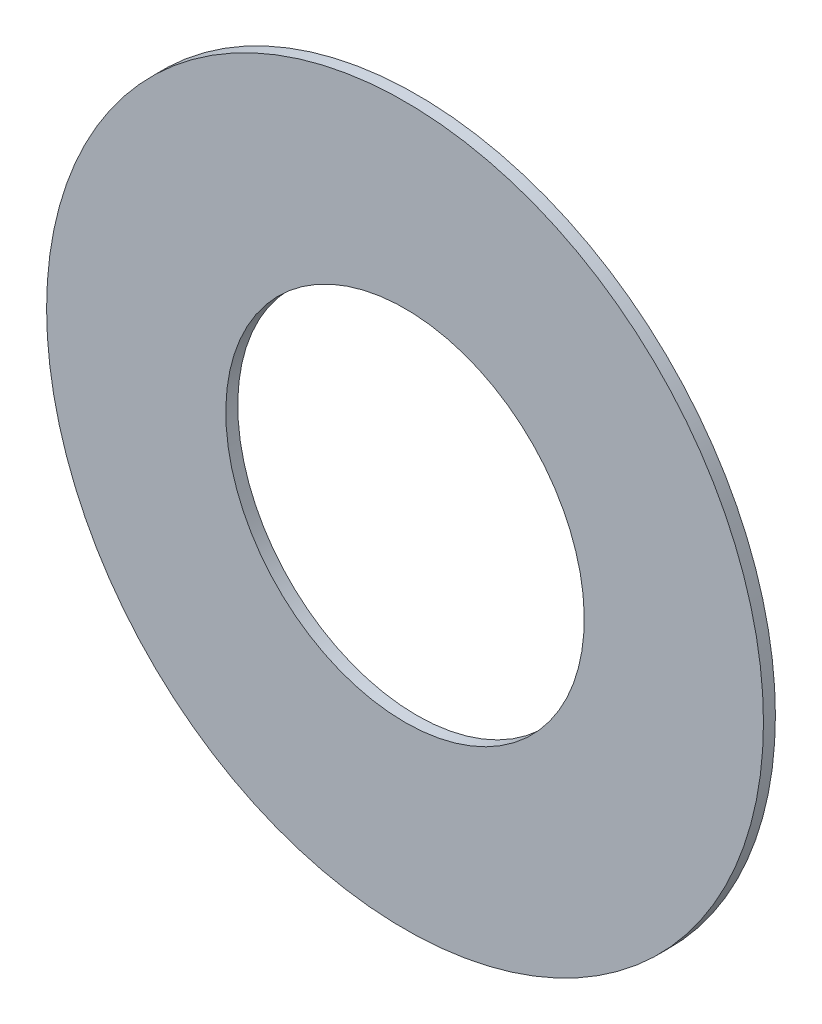
ISO-10303-21;
HEADER;
FILE_DESCRIPTION(('STEP AP214'),'2;1');
FILE_NAME('part.step','',(''),(''),'','','');
FILE_SCHEMA(('AUTOMOTIVE_DESIGN { 1 0 10303 214 1 1 1 1 }'));
ENDSEC;
DATA;
#1=APPLICATION_CONTEXT('core data for automotive mechanical design processes');
#2=APPLICATION_PROTOCOL_DEFINITION('international standard','automotive_design',2000,#1);
#3=PRODUCT_CONTEXT('',#1,'mechanical');
#4=PRODUCT('Part','Part','',(#3));
#5=PRODUCT_RELATED_PRODUCT_CATEGORY('part','',(#4));
#6=PRODUCT_DEFINITION_FORMATION('','',#4);
#7=PRODUCT_DEFINITION_CONTEXT('part definition',#1,'design');
#8=PRODUCT_DEFINITION('design','',#6,#7);
#9=PRODUCT_DEFINITION_SHAPE('','',#8);
#10=(LENGTH_UNIT() NAMED_UNIT(*) SI_UNIT(.MILLI.,.METRE.));
#11=(NAMED_UNIT(*) PLANE_ANGLE_UNIT() SI_UNIT($,.RADIAN.));
#12=(NAMED_UNIT(*) SI_UNIT($,.STERADIAN.) SOLID_ANGLE_UNIT());
#13=UNCERTAINTY_MEASURE_WITH_UNIT(LENGTH_MEASURE(1.E-05),#10,'distance_accuracy_value','');
#14=(GEOMETRIC_REPRESENTATION_CONTEXT(3) GLOBAL_UNCERTAINTY_ASSIGNED_CONTEXT((#13)) GLOBAL_UNIT_ASSIGNED_CONTEXT((#10,
#11,#12)) REPRESENTATION_CONTEXT('',''));
#15=CARTESIAN_POINT('',(0.,0.,0.));
#16=DIRECTION('',(0.,0.,1.));
#17=DIRECTION('',(1.,0.,0.));
#18=AXIS2_PLACEMENT_3D('',#15,#16,#17);
#19=CARTESIAN_POINT('',(126.802,-114.284,-0.045));
#20=DIRECTION('',(0.,0.,-1.));
#21=DIRECTION('',(0.,-1.,0.));
#22=AXIS2_PLACEMENT_3D('',#19,#20,#21);
#23=CYLINDRICAL_SURFACE('',#22,0.525);
#24=CARTESIAN_POINT('',(126.802,-114.284,-0.035));
#25=DIRECTION('',(0.,0.,-1.));
#26=DIRECTION('',(0.,-1.,0.));
#27=AXIS2_PLACEMENT_3D('',#24,#25,#26);
#28=CIRCLE('',#27,0.525);
#29=CARTESIAN_POINT('',(126.802,-114.809,-0.035));
#30=VERTEX_POINT('',#29);
#31=EDGE_CURVE('E25',#30,#30,#28,.T.);
#32=ORIENTED_EDGE('',*,*,#31,.T.);
#33=DIRECTION('',(0.,0.,1.));
#34=VECTOR('',#33,1.);
#35=CARTESIAN_POINT('',(126.802,-114.809,-0.045));
#36=LINE('',#35,#34);
#37=CARTESIAN_POINT('',(126.802,-114.809,0.));
#38=VERTEX_POINT('',#37);
#39=EDGE_CURVE('E11',#30,#38,#36,.T.);
#40=ORIENTED_EDGE('',*,*,#39,.T.);
#41=CARTESIAN_POINT('',(126.802,-114.284,0.));
#42=DIRECTION('',(0.,0.,-1.));
#43=DIRECTION('',(0.,-1.,0.));
#44=AXIS2_PLACEMENT_3D('',#41,#42,#43);
#45=CIRCLE('',#44,0.525);
#46=EDGE_CURVE('E68',#38,#38,#45,.T.);
#47=ORIENTED_EDGE('',*,*,#46,.F.);
#48=ORIENTED_EDGE('',*,*,#39,.F.);
#49=EDGE_LOOP('',(#32,#40,#47,#48));
#50=FACE_BOUND('',#49,.T.);
#51=ADVANCED_FACE('F17',(#50),#23,.F.);
#52=CARTESIAN_POINT('',(126.802,-114.284,-0.035));
#53=DIRECTION('',(0.,0.,1.));
#54=DIRECTION('',(1.,0.,0.));
#55=AXIS2_PLACEMENT_3D('',#52,#53,#54);
#56=PLANE('',#55);
#57=ORIENTED_EDGE('',*,*,#31,.F.);
#58=EDGE_LOOP('',(#57));
#59=FACE_BOUND('',#58,.T.);
#60=CARTESIAN_POINT('',(126.802,-114.284,-0.035));
#61=DIRECTION('',(0.,0.,1.));
#62=DIRECTION('',(1.,0.,0.));
#63=AXIS2_PLACEMENT_3D('',#60,#61,#62);
#64=CIRCLE('',#63,1.05);
#65=CARTESIAN_POINT('',(127.852,-114.284,-0.035));
#66=VERTEX_POINT('',#65);
#67=EDGE_CURVE('E56',#66,#66,#64,.T.);
#68=ORIENTED_EDGE('',*,*,#67,.F.);
#69=EDGE_LOOP('',(#68));
#70=FACE_BOUND('',#69,.T.);
#71=ADVANCED_FACE('F75',(#59,#70),#56,.F.);
#72=CARTESIAN_POINT('',(126.802,-114.284,0.));
#73=DIRECTION('',(0.,0.,1.));
#74=DIRECTION('',(1.,0.,0.));
#75=AXIS2_PLACEMENT_3D('',#72,#73,#74);
#76=PLANE('',#75);
#77=ORIENTED_EDGE('',*,*,#46,.T.);
#78=EDGE_LOOP('',(#77));
#79=FACE_BOUND('',#78,.T.);
#80=CARTESIAN_POINT('',(126.802,-114.284,0.));
#81=DIRECTION('',(0.,0.,1.));
#82=DIRECTION('',(1.,0.,0.));
#83=AXIS2_PLACEMENT_3D('',#80,#81,#82);
#84=CIRCLE('',#83,1.05);
#85=CARTESIAN_POINT('',(127.852,-114.284,0.));
#86=VERTEX_POINT('',#85);
#87=EDGE_CURVE('E54',#86,#86,#84,.T.);
#88=ORIENTED_EDGE('',*,*,#87,.T.);
#89=EDGE_LOOP('',(#88));
#90=FACE_BOUND('',#89,.T.);
#91=ADVANCED_FACE('F60',(#79,#90),#76,.T.);
#92=CARTESIAN_POINT('',(126.802,-114.284,-0.035));
#93=DIRECTION('',(0.,0.,1.));
#94=DIRECTION('',(1.,0.,0.));
#95=AXIS2_PLACEMENT_3D('',#92,#93,#94);
#96=CYLINDRICAL_SURFACE('',#95,1.05);
#97=ORIENTED_EDGE('',*,*,#87,.F.);
#98=DIRECTION('',(0.,0.,1.));
#99=VECTOR('',#98,1.);
#100=CARTESIAN_POINT('',(127.852,-114.284,-0.035));
#101=LINE('',#100,#99);
#102=EDGE_CURVE('E51',#66,#86,#101,.T.);
#103=ORIENTED_EDGE('',*,*,#102,.F.);
#104=ORIENTED_EDGE('',*,*,#67,.T.);
#105=ORIENTED_EDGE('',*,*,#102,.T.);
#106=EDGE_LOOP('',(#97,#103,#104,#105));
#107=FACE_BOUND('',#106,.T.);
#108=ADVANCED_FACE('F53',(#107),#96,.T.);
#109=CLOSED_SHELL('',(#51,#71,#91,#108));
#110=MANIFOLD_SOLID_BREP('B1',#109);
#111=ADVANCED_BREP_SHAPE_REPRESENTATION('',(#18,#110),#14);
#112=SHAPE_DEFINITION_REPRESENTATION(#9,#111);
ENDSEC;
END-ISO-10303-21;
